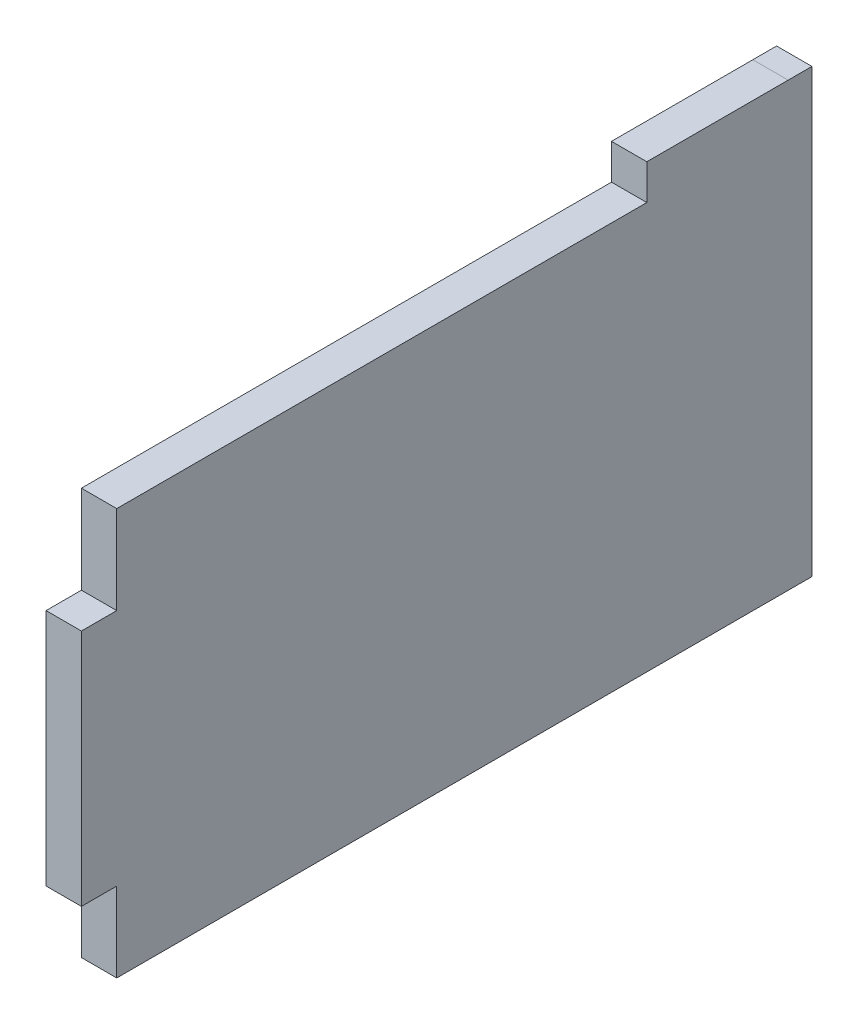
ISO-10303-21;
HEADER;
FILE_DESCRIPTION(('STEP AP214'),'2;1');
FILE_NAME('part.step','',(''),(''),'','','');
FILE_SCHEMA(('AUTOMOTIVE_DESIGN { 1 0 10303 214 1 1 1 1 }'));
ENDSEC;
DATA;
#1=APPLICATION_CONTEXT('core data for automotive mechanical design processes');
#2=APPLICATION_PROTOCOL_DEFINITION('international standard','automotive_design',2000,#1);
#3=PRODUCT_CONTEXT('',#1,'mechanical');
#4=PRODUCT('Part','Part','',(#3));
#5=PRODUCT_RELATED_PRODUCT_CATEGORY('part','',(#4));
#6=PRODUCT_DEFINITION_FORMATION('','',#4);
#7=PRODUCT_DEFINITION_CONTEXT('part definition',#1,'design');
#8=PRODUCT_DEFINITION('design','',#6,#7);
#9=PRODUCT_DEFINITION_SHAPE('','',#8);
#10=(LENGTH_UNIT() NAMED_UNIT(*) SI_UNIT(.MILLI.,.METRE.));
#11=(NAMED_UNIT(*) PLANE_ANGLE_UNIT() SI_UNIT($,.RADIAN.));
#12=(NAMED_UNIT(*) SI_UNIT($,.STERADIAN.) SOLID_ANGLE_UNIT());
#13=UNCERTAINTY_MEASURE_WITH_UNIT(LENGTH_MEASURE(1.E-05),#10,'distance_accuracy_value','');
#14=(GEOMETRIC_REPRESENTATION_CONTEXT(3) GLOBAL_UNCERTAINTY_ASSIGNED_CONTEXT((#13)) GLOBAL_UNIT_ASSIGNED_CONTEXT((#10,
#11,#12)) REPRESENTATION_CONTEXT('',''));
#15=CARTESIAN_POINT('',(0.,0.,0.));
#16=DIRECTION('',(0.,0.,1.));
#17=DIRECTION('',(1.,0.,0.));
#18=AXIS2_PLACEMENT_3D('',#15,#16,#17);
#19=CARTESIAN_POINT('',(4.,0.,-0.999999999999995));
#20=DIRECTION('',(0.,0.,-1.));
#21=DIRECTION('',(0.,1.,0.));
#22=AXIS2_PLACEMENT_3D('',#19,#20,#21);
#23=PLANE('',#22);
#24=DIRECTION('',(0.,-1.,0.));
#25=VECTOR('',#24,1.);
#26=CARTESIAN_POINT('',(0.,0.,-0.999999999999995));
#27=LINE('',#26,#25);
#28=CARTESIAN_POINT('',(0.,0.,-0.999999999999995));
#29=VERTEX_POINT('',#28);
#30=CARTESIAN_POINT('',(0.,-10.,-1.));
#31=VERTEX_POINT('',#30);
#32=EDGE_CURVE('E160',#29,#31,#27,.T.);
#33=ORIENTED_EDGE('',*,*,#32,.T.);
#34=DIRECTION('',(-1.,0.,0.));
#35=VECTOR('',#34,1.);
#36=CARTESIAN_POINT('',(4.,-10.,-1.));
#37=LINE('',#36,#35);
#38=CARTESIAN_POINT('',(4.,-10.,-1.));
#39=VERTEX_POINT('',#38);
#40=EDGE_CURVE('E11',#39,#31,#37,.T.);
#41=ORIENTED_EDGE('',*,*,#40,.F.);
#42=DIRECTION('',(0.,-1.,0.));
#43=VECTOR('',#42,1.);
#44=CARTESIAN_POINT('',(4.,0.,-0.999999999999995));
#45=LINE('',#44,#43);
#46=CARTESIAN_POINT('',(4.,0.,-0.999999999999995));
#47=VERTEX_POINT('',#46);
#48=EDGE_CURVE('E185',#47,#39,#45,.T.);
#49=ORIENTED_EDGE('',*,*,#48,.F.);
#50=DIRECTION('',(-1.,0.,0.));
#51=VECTOR('',#50,1.);
#52=CARTESIAN_POINT('',(4.,0.,-0.999999999999995));
#53=LINE('',#52,#51);
#54=EDGE_CURVE('E155',#47,#29,#53,.T.);
#55=ORIENTED_EDGE('',*,*,#54,.T.);
#56=EDGE_LOOP('',(#33,#41,#49,#55));
#57=FACE_BOUND('',#56,.T.);
#58=ADVANCED_FACE('F49',(#57),#23,.F.);
#59=CARTESIAN_POINT('',(4.,-10.,3.));
#60=DIRECTION('',(0.,-1.,0.));
#61=DIRECTION('',(0.,0.,-1.));
#62=AXIS2_PLACEMENT_3D('',#59,#60,#61);
#63=PLANE('',#62);
#64=DIRECTION('',(0.,0.,1.));
#65=VECTOR('',#64,1.);
#66=CARTESIAN_POINT('',(0.,-10.,3.));
#67=LINE('',#66,#65);
#68=CARTESIAN_POINT('',(0.,-10.,3.));
#69=VERTEX_POINT('',#68);
#70=EDGE_CURVE('E164',#31,#69,#67,.T.);
#71=ORIENTED_EDGE('',*,*,#70,.T.);
#72=DIRECTION('',(-1.,0.,0.));
#73=VECTOR('',#72,1.);
#74=CARTESIAN_POINT('',(4.,-10.,3.));
#75=LINE('',#74,#73);
#76=CARTESIAN_POINT('',(4.,-10.,3.));
#77=VERTEX_POINT('',#76);
#78=EDGE_CURVE('E59',#77,#69,#75,.T.);
#79=ORIENTED_EDGE('',*,*,#78,.F.);
#80=DIRECTION('',(0.,0.,1.));
#81=VECTOR('',#80,1.);
#82=CARTESIAN_POINT('',(4.,-10.,3.));
#83=LINE('',#82,#81);
#84=EDGE_CURVE('E112',#39,#77,#83,.T.);
#85=ORIENTED_EDGE('',*,*,#84,.F.);
#86=ORIENTED_EDGE('',*,*,#40,.T.);
#87=EDGE_LOOP('',(#71,#79,#85,#86));
#88=FACE_BOUND('',#87,.T.);
#89=ADVANCED_FACE('F234',(#88),#63,.F.);
#90=CARTESIAN_POINT('',(4.,-10.,3.));
#91=DIRECTION('',(0.,0.,-1.));
#92=DIRECTION('',(0.,1.,0.));
#93=AXIS2_PLACEMENT_3D('',#90,#91,#92);
#94=PLANE('',#93);
#95=DIRECTION('',(0.,-1.,0.));
#96=VECTOR('',#95,1.);
#97=CARTESIAN_POINT('',(0.,-10.,3.));
#98=LINE('',#97,#96);
#99=CARTESIAN_POINT('',(0.,-37.,2.99999999999999));
#100=VERTEX_POINT('',#99);
#101=EDGE_CURVE('E168',#69,#100,#98,.T.);
#102=ORIENTED_EDGE('',*,*,#101,.T.);
#103=DIRECTION('',(-1.,0.,0.));
#104=VECTOR('',#103,1.);
#105=CARTESIAN_POINT('',(4.,-37.,2.99999999999999));
#106=LINE('',#105,#104);
#107=CARTESIAN_POINT('',(4.,-37.,2.99999999999999));
#108=VERTEX_POINT('',#107);
#109=EDGE_CURVE('E197',#108,#100,#106,.T.);
#110=ORIENTED_EDGE('',*,*,#109,.F.);
#111=DIRECTION('',(0.,-1.,0.));
#112=VECTOR('',#111,1.);
#113=CARTESIAN_POINT('',(4.,-10.,3.));
#114=LINE('',#113,#112);
#115=EDGE_CURVE('E247',#77,#108,#114,.T.);
#116=ORIENTED_EDGE('',*,*,#115,.F.);
#117=ORIENTED_EDGE('',*,*,#78,.T.);
#118=EDGE_LOOP('',(#102,#110,#116,#117));
#119=FACE_BOUND('',#118,.T.);
#120=ADVANCED_FACE('F231',(#119),#94,.F.);
#121=CARTESIAN_POINT('',(4.,-37.,2.99999999999999));
#122=DIRECTION('',(0.,1.,0.));
#123=DIRECTION('',(0.,0.,1.));
#124=AXIS2_PLACEMENT_3D('',#121,#122,#123);
#125=PLANE('',#124);
#126=DIRECTION('',(0.,0.,-1.));
#127=VECTOR('',#126,1.);
#128=CARTESIAN_POINT('',(0.,-37.,2.99999999999999));
#129=LINE('',#128,#127);
#130=CARTESIAN_POINT('',(0.,-37.,-1.00000000000001));
#131=VERTEX_POINT('',#130);
#132=EDGE_CURVE('E171',#100,#131,#129,.T.);
#133=ORIENTED_EDGE('',*,*,#132,.T.);
#134=DIRECTION('',(-1.,0.,0.));
#135=VECTOR('',#134,1.);
#136=CARTESIAN_POINT('',(4.,-37.,-1.00000000000001));
#137=LINE('',#136,#135);
#138=CARTESIAN_POINT('',(4.,-37.,-1.00000000000001));
#139=VERTEX_POINT('',#138);
#140=EDGE_CURVE('E193',#139,#131,#137,.T.);
#141=ORIENTED_EDGE('',*,*,#140,.F.);
#142=DIRECTION('',(0.,0.,-1.));
#143=VECTOR('',#142,1.);
#144=CARTESIAN_POINT('',(4.,-37.,2.99999999999999));
#145=LINE('',#144,#143);
#146=EDGE_CURVE('E259',#108,#139,#145,.T.);
#147=ORIENTED_EDGE('',*,*,#146,.F.);
#148=ORIENTED_EDGE('',*,*,#109,.T.);
#149=EDGE_LOOP('',(#133,#141,#147,#148));
#150=FACE_BOUND('',#149,.T.);
#151=ADVANCED_FACE('F227',(#150),#125,.F.);
#152=CARTESIAN_POINT('',(4.,-37.,-1.00000000000001));
#153=DIRECTION('',(0.,0.,-1.));
#154=DIRECTION('',(0.,1.,0.));
#155=AXIS2_PLACEMENT_3D('',#152,#153,#154);
#156=PLANE('',#155);
#157=DIRECTION('',(0.,-1.,0.));
#158=VECTOR('',#157,1.);
#159=CARTESIAN_POINT('',(0.,-37.,-1.00000000000001));
#160=LINE('',#159,#158);
#161=CARTESIAN_POINT('',(0.,-46.015400021199,-1.));
#162=VERTEX_POINT('',#161);
#163=EDGE_CURVE('E174',#131,#162,#160,.T.);
#164=ORIENTED_EDGE('',*,*,#163,.T.);
#165=DIRECTION('',(-1.,0.,0.));
#166=VECTOR('',#165,1.);
#167=CARTESIAN_POINT('',(4.,-46.015400021199,-1.));
#168=LINE('',#167,#166);
#169=CARTESIAN_POINT('',(4.,-46.015400021199,-1.));
#170=VERTEX_POINT('',#169);
#171=EDGE_CURVE('E148',#170,#162,#168,.T.);
#172=ORIENTED_EDGE('',*,*,#171,.F.);
#173=DIRECTION('',(0.,-1.,0.));
#174=VECTOR('',#173,1.);
#175=CARTESIAN_POINT('',(4.,-37.,-1.00000000000001));
#176=LINE('',#175,#174);
#177=EDGE_CURVE('E256',#139,#170,#176,.T.);
#178=ORIENTED_EDGE('',*,*,#177,.F.);
#179=ORIENTED_EDGE('',*,*,#140,.T.);
#180=EDGE_LOOP('',(#164,#172,#178,#179));
#181=FACE_BOUND('',#180,.T.);
#182=ADVANCED_FACE('F223',(#181),#156,.F.);
#183=CARTESIAN_POINT('',(4.,-46.015400021199,-1.));
#184=DIRECTION('',(0.,1.,0.));
#185=DIRECTION('',(0.,0.,1.));
#186=AXIS2_PLACEMENT_3D('',#183,#184,#185);
#187=PLANE('',#186);
#188=DIRECTION('',(0.,0.,-1.));
#189=VECTOR('',#188,1.);
#190=CARTESIAN_POINT('',(0.,-46.015400021199,-1.));
#191=LINE('',#190,#189);
#192=CARTESIAN_POINT('',(0.,-46.015400021199,-79.69));
#193=VERTEX_POINT('',#192);
#194=EDGE_CURVE('E177',#162,#193,#191,.T.);
#195=ORIENTED_EDGE('',*,*,#194,.T.);
#196=DIRECTION('',(-1.,0.,0.));
#197=VECTOR('',#196,1.);
#198=CARTESIAN_POINT('',(4.,-46.015400021199,-79.69));
#199=LINE('',#198,#197);
#200=CARTESIAN_POINT('',(4.,-46.015400021199,-79.69));
#201=VERTEX_POINT('',#200);
#202=EDGE_CURVE('E450',#201,#193,#199,.T.);
#203=ORIENTED_EDGE('',*,*,#202,.F.);
#204=DIRECTION('',(0.,0.,-1.));
#205=VECTOR('',#204,1.);
#206=CARTESIAN_POINT('',(4.,-46.015400021199,-1.));
#207=LINE('',#206,#205);
#208=EDGE_CURVE('E141',#170,#201,#207,.T.);
#209=ORIENTED_EDGE('',*,*,#208,.F.);
#210=ORIENTED_EDGE('',*,*,#171,.T.);
#211=EDGE_LOOP('',(#195,#203,#209,#210));
#212=FACE_BOUND('',#211,.T.);
#213=ADVANCED_FACE('F219',(#212),#187,.F.);
#214=CARTESIAN_POINT('',(4.,3.99999999999999,-61.));
#215=DIRECTION('',(0.,-1.,0.));
#216=DIRECTION('',(0.,0.,-1.));
#217=AXIS2_PLACEMENT_3D('',#214,#215,#216);
#218=PLANE('',#217);
#219=DIRECTION('',(0.,0.,1.));
#220=VECTOR('',#219,1.);
#221=CARTESIAN_POINT('',(4.,3.99999999999999,-61.));
#222=LINE('',#221,#220);
#223=CARTESIAN_POINT('',(4.,3.99972635971335,-77.));
#224=VERTEX_POINT('',#223);
#225=CARTESIAN_POINT('',(4.,3.99999999999999,-61.));
#226=VERTEX_POINT('',#225);
#227=EDGE_CURVE('E128',#224,#226,#222,.T.);
#228=ORIENTED_EDGE('',*,*,#227,.F.);
#229=CARTESIAN_POINT('',(4.,3.99999999999999,-77.));
#230=DIRECTION('',(-1.,0.,0.));
#231=VECTOR('',#230,1.);
#232=LINE('',#229,#231);
#233=CARTESIAN_POINT('',(0.,3.99972635971335,-77.));
#234=VERTEX_POINT('',#233);
#235=EDGE_CURVE('E165',#224,#234,#232,.T.);
#236=ORIENTED_EDGE('',*,*,#235,.T.);
#237=DIRECTION('',(0.,0.,1.));
#238=VECTOR('',#237,1.);
#239=CARTESIAN_POINT('',(0.,3.99999999999999,-61.));
#240=LINE('',#239,#238);
#241=CARTESIAN_POINT('',(0.,3.99999999999999,-61.));
#242=VERTEX_POINT('',#241);
#243=EDGE_CURVE('E146',#234,#242,#240,.T.);
#244=ORIENTED_EDGE('',*,*,#243,.T.);
#245=DIRECTION('',(-1.,0.,0.));
#246=VECTOR('',#245,1.);
#247=CARTESIAN_POINT('',(4.,3.99999999999999,-61.));
#248=LINE('',#247,#246);
#249=EDGE_CURVE('E143',#226,#242,#248,.T.);
#250=ORIENTED_EDGE('',*,*,#249,.F.);
#251=EDGE_LOOP('',(#228,#236,#244,#250));
#252=FACE_BOUND('',#251,.T.);
#253=ADVANCED_FACE('F144',(#252),#218,.F.);
#254=CARTESIAN_POINT('',(4.,3.99999999999999,-61.));
#255=DIRECTION('',(0.,0.,-1.));
#256=DIRECTION('',(-1.,0.,0.));
#257=AXIS2_PLACEMENT_3D('',#254,#255,#256);
#258=PLANE('',#257);
#259=DIRECTION('',(0.,-1.,0.));
#260=VECTOR('',#259,1.);
#261=CARTESIAN_POINT('',(0.,3.99999999999999,-61.));
#262=LINE('',#261,#260);
#263=CARTESIAN_POINT('',(0.,0.,-61.));
#264=VERTEX_POINT('',#263);
#265=EDGE_CURVE('E98',#242,#264,#262,.T.);
#266=ORIENTED_EDGE('',*,*,#265,.T.);
#267=DIRECTION('',(-1.,0.,0.));
#268=VECTOR('',#267,1.);
#269=CARTESIAN_POINT('',(4.,0.,-61.));
#270=LINE('',#269,#268);
#271=CARTESIAN_POINT('',(4.,0.,-61.));
#272=VERTEX_POINT('',#271);
#273=EDGE_CURVE('E149',#272,#264,#270,.T.);
#274=ORIENTED_EDGE('',*,*,#273,.F.);
#275=DIRECTION('',(0.,-1.,0.));
#276=VECTOR('',#275,1.);
#277=CARTESIAN_POINT('',(4.,3.99999999999999,-61.));
#278=LINE('',#277,#276);
#279=EDGE_CURVE('E133',#226,#272,#278,.T.);
#280=ORIENTED_EDGE('',*,*,#279,.F.);
#281=ORIENTED_EDGE('',*,*,#249,.T.);
#282=EDGE_LOOP('',(#266,#274,#280,#281));
#283=FACE_BOUND('',#282,.T.);
#284=ADVANCED_FACE('F151',(#283),#258,.F.);
#285=CARTESIAN_POINT('',(4.,0.,-0.999999999999995));
#286=DIRECTION('',(0.,-1.,0.));
#287=DIRECTION('',(0.,0.,-1.));
#288=AXIS2_PLACEMENT_3D('',#285,#286,#287);
#289=PLANE('',#288);
#290=DIRECTION('',(0.,0.,1.));
#291=VECTOR('',#290,1.);
#292=CARTESIAN_POINT('',(0.,0.,-0.999999999999995));
#293=LINE('',#292,#291);
#294=EDGE_CURVE('E104',#264,#29,#293,.T.);
#295=ORIENTED_EDGE('',*,*,#294,.T.);
#296=ORIENTED_EDGE('',*,*,#54,.F.);
#297=DIRECTION('',(0.,0.,1.));
#298=VECTOR('',#297,1.);
#299=CARTESIAN_POINT('',(4.,0.,-0.999999999999995));
#300=LINE('',#299,#298);
#301=EDGE_CURVE('E68',#272,#47,#300,.T.);
#302=ORIENTED_EDGE('',*,*,#301,.F.);
#303=ORIENTED_EDGE('',*,*,#273,.T.);
#304=EDGE_LOOP('',(#295,#296,#302,#303));
#305=FACE_BOUND('',#304,.T.);
#306=ADVANCED_FACE('F300',(#305),#289,.F.);
#307=CARTESIAN_POINT('',(4.,0.,0.));
#308=DIRECTION('',(1.,0.,0.));
#309=DIRECTION('',(0.,0.,-1.));
#310=AXIS2_PLACEMENT_3D('',#307,#308,#309);
#311=PLANE('',#310);
#312=ORIENTED_EDGE('',*,*,#208,.T.);
#313=DIRECTION('',(0.,-1.,0.));
#314=VECTOR('',#313,1.);
#315=CARTESIAN_POINT('',(4.,3.9994527194267,-79.69));
#316=LINE('',#315,#314);
#317=CARTESIAN_POINT('',(4.,3.9994527194267,-79.69));
#318=VERTEX_POINT('',#317);
#319=EDGE_CURVE('E446',#318,#201,#316,.T.);
#320=ORIENTED_EDGE('',*,*,#319,.F.);
#321=DIRECTION('',(0.,0.,1.));
#322=VECTOR('',#321,1.);
#323=CARTESIAN_POINT('',(4.,3.9994527194267,-79.69));
#324=LINE('',#323,#322);
#325=EDGE_CURVE('E137',#318,#224,#324,.T.);
#326=ORIENTED_EDGE('',*,*,#325,.T.);
#327=ORIENTED_EDGE('',*,*,#227,.T.);
#328=ORIENTED_EDGE('',*,*,#279,.T.);
#329=ORIENTED_EDGE('',*,*,#301,.T.);
#330=ORIENTED_EDGE('',*,*,#48,.T.);
#331=ORIENTED_EDGE('',*,*,#84,.T.);
#332=ORIENTED_EDGE('',*,*,#115,.T.);
#333=ORIENTED_EDGE('',*,*,#146,.T.);
#334=ORIENTED_EDGE('',*,*,#177,.T.);
#335=EDGE_LOOP('',(#312,#320,#326,#327,#328,#329,#330,#331,#332,#333,#334));
#336=FACE_BOUND('',#335,.T.);
#337=ADVANCED_FACE('F131',(#336),#311,.T.);
#338=CARTESIAN_POINT('',(0.,0.,0.));
#339=DIRECTION('',(1.,0.,0.));
#340=DIRECTION('',(0.,0.,-1.));
#341=AXIS2_PLACEMENT_3D('',#338,#339,#340);
#342=PLANE('',#341);
#343=ORIENTED_EDGE('',*,*,#243,.F.);
#344=DIRECTION('',(0.,0.,1.));
#345=VECTOR('',#344,1.);
#346=CARTESIAN_POINT('',(0.,3.9994527194267,-79.69));
#347=LINE('',#346,#345);
#348=CARTESIAN_POINT('',(0.,3.9994527194267,-79.69));
#349=VERTEX_POINT('',#348);
#350=EDGE_CURVE('E274',#349,#234,#347,.T.);
#351=ORIENTED_EDGE('',*,*,#350,.F.);
#352=DIRECTION('',(0.,1.,0.));
#353=VECTOR('',#352,1.);
#354=CARTESIAN_POINT('',(0.,3.9994527194267,-79.69));
#355=LINE('',#354,#353);
#356=EDGE_CURVE('E458',#193,#349,#355,.T.);
#357=ORIENTED_EDGE('',*,*,#356,.F.);
#358=ORIENTED_EDGE('',*,*,#194,.F.);
#359=ORIENTED_EDGE('',*,*,#163,.F.);
#360=ORIENTED_EDGE('',*,*,#132,.F.);
#361=ORIENTED_EDGE('',*,*,#101,.F.);
#362=ORIENTED_EDGE('',*,*,#70,.F.);
#363=ORIENTED_EDGE('',*,*,#32,.F.);
#364=ORIENTED_EDGE('',*,*,#294,.F.);
#365=ORIENTED_EDGE('',*,*,#265,.F.);
#366=EDGE_LOOP('',(#343,#351,#357,#358,#359,#360,#361,#362,#363,#364,#365));
#367=FACE_BOUND('',#366,.T.);
#368=ADVANCED_FACE('F249',(#367),#342,.F.);
#369=CARTESIAN_POINT('',(4.,3.9994527194267,-79.69));
#370=DIRECTION('',(0.,-1.,0.));
#371=DIRECTION('',(0.,0.,-1.));
#372=AXIS2_PLACEMENT_3D('',#369,#370,#371);
#373=PLANE('',#372);
#374=ORIENTED_EDGE('',*,*,#235,.F.);
#375=ORIENTED_EDGE('',*,*,#325,.F.);
#376=DIRECTION('',(1.,0.,0.));
#377=VECTOR('',#376,1.);
#378=CARTESIAN_POINT('',(4.,3.9994527194267,-79.69));
#379=LINE('',#378,#377);
#380=EDGE_CURVE('E275',#349,#318,#379,.T.);
#381=ORIENTED_EDGE('',*,*,#380,.F.);
#382=ORIENTED_EDGE('',*,*,#350,.T.);
#383=EDGE_LOOP('',(#374,#375,#381,#382));
#384=FACE_BOUND('',#383,.T.);
#385=ADVANCED_FACE('F286',(#384),#373,.F.);
#386=CARTESIAN_POINT('',(0.,0.,-79.69));
#387=DIRECTION('',(0.,0.,-1.));
#388=DIRECTION('',(-1.,0.,0.));
#389=AXIS2_PLACEMENT_3D('',#386,#387,#388);
#390=PLANE('',#389);
#391=ORIENTED_EDGE('',*,*,#319,.T.);
#392=ORIENTED_EDGE('',*,*,#202,.T.);
#393=ORIENTED_EDGE('',*,*,#356,.T.);
#394=ORIENTED_EDGE('',*,*,#380,.T.);
#395=EDGE_LOOP('',(#391,#392,#393,#394));
#396=FACE_BOUND('',#395,.T.);
#397=ADVANCED_FACE('F296',(#396),#390,.T.);
#398=CLOSED_SHELL('',(#58,#89,#120,#151,#182,#213,#253,#284,#306,#337,#368,#385,#397));
#399=MANIFOLD_SOLID_BREP('B2',#398);
#400=ADVANCED_BREP_SHAPE_REPRESENTATION('',(#18,#399),#14);
#401=SHAPE_DEFINITION_REPRESENTATION(#9,#400);
ENDSEC;
END-ISO-10303-21;
